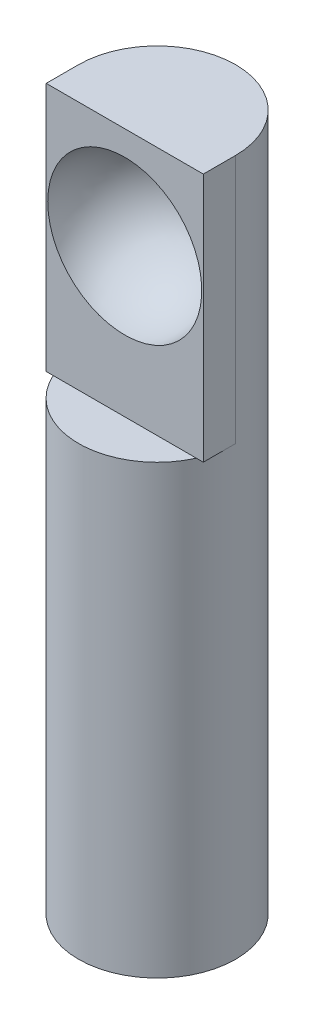
ISO-10303-21;
HEADER;
FILE_DESCRIPTION(('STEP AP214'),'2;1');
FILE_NAME('part.step','',(''),(''),'','','');
FILE_SCHEMA(('AUTOMOTIVE_DESIGN { 1 0 10303 214 1 1 1 1 }'));
ENDSEC;
DATA;
#1=APPLICATION_CONTEXT('core data for automotive mechanical design processes');
#2=APPLICATION_PROTOCOL_DEFINITION('international standard','automotive_design',2000,#1);
#3=PRODUCT_CONTEXT('',#1,'mechanical');
#4=PRODUCT('Part','Part','',(#3));
#5=PRODUCT_RELATED_PRODUCT_CATEGORY('part','',(#4));
#6=PRODUCT_DEFINITION_FORMATION('','',#4);
#7=PRODUCT_DEFINITION_CONTEXT('part definition',#1,'design');
#8=PRODUCT_DEFINITION('design','',#6,#7);
#9=PRODUCT_DEFINITION_SHAPE('','',#8);
#10=(LENGTH_UNIT() NAMED_UNIT(*) SI_UNIT(.MILLI.,.METRE.));
#11=(NAMED_UNIT(*) PLANE_ANGLE_UNIT() SI_UNIT($,.RADIAN.));
#12=(NAMED_UNIT(*) SI_UNIT($,.STERADIAN.) SOLID_ANGLE_UNIT());
#13=UNCERTAINTY_MEASURE_WITH_UNIT(LENGTH_MEASURE(1.E-05),#10,'distance_accuracy_value','');
#14=(GEOMETRIC_REPRESENTATION_CONTEXT(3) GLOBAL_UNCERTAINTY_ASSIGNED_CONTEXT((#13)) GLOBAL_UNIT_ASSIGNED_CONTEXT((#10,
#11,#12)) REPRESENTATION_CONTEXT('',''));
#15=CARTESIAN_POINT('',(0.,0.,0.));
#16=DIRECTION('',(0.,0.,1.));
#17=DIRECTION('',(1.,0.,0.));
#18=AXIS2_PLACEMENT_3D('',#15,#16,#17);
#19=CARTESIAN_POINT('',(-2.55,11.3,2.55));
#20=DIRECTION('',(0.,-1.,0.));
#21=DIRECTION('',(0.,0.,-1.));
#22=AXIS2_PLACEMENT_3D('',#19,#20,#21);
#23=PLANE('',#22);
#24=DIRECTION('',(0.,0.,-1.));
#25=VECTOR('',#24,1.);
#26=CARTESIAN_POINT('',(2.55,11.3,2.55));
#27=LINE('',#26,#25);
#28=CARTESIAN_POINT('',(2.55,11.3,1.05));
#29=VERTEX_POINT('',#28);
#30=CARTESIAN_POINT('',(2.55,11.3,0.));
#31=VERTEX_POINT('',#30);
#32=EDGE_CURVE('E77',#29,#31,#27,.T.);
#33=ORIENTED_EDGE('',*,*,#32,.T.);
#34=CARTESIAN_POINT('',(0.,11.3,0.));
#35=DIRECTION('',(0.,-1.,0.));
#36=DIRECTION('',(0.,0.,-1.));
#37=AXIS2_PLACEMENT_3D('',#34,#35,#36);
#38=CIRCLE('',#37,2.55);
#39=CARTESIAN_POINT('',(-2.55,11.3,0.));
#40=VERTEX_POINT('',#39);
#41=EDGE_CURVE('E115',#31,#40,#38,.F.);
#42=ORIENTED_EDGE('',*,*,#41,.T.);
#43=DIRECTION('',(0.,0.,-1.));
#44=VECTOR('',#43,1.);
#45=CARTESIAN_POINT('',(-2.55,11.3,2.55));
#46=LINE('',#45,#44);
#47=CARTESIAN_POINT('',(-2.55,11.3,1.05));
#48=VERTEX_POINT('',#47);
#49=EDGE_CURVE('E133',#48,#40,#46,.T.);
#50=ORIENTED_EDGE('',*,*,#49,.F.);
#51=DIRECTION('',(-1.,0.,0.));
#52=VECTOR('',#51,1.);
#53=CARTESIAN_POINT('',(2.55,11.3,1.05));
#54=LINE('',#53,#52);
#55=EDGE_CURVE('E132',#29,#48,#54,.T.);
#56=ORIENTED_EDGE('',*,*,#55,.F.);
#57=EDGE_LOOP('',(#33,#42,#50,#56));
#58=FACE_BOUND('',#57,.T.);
#59=ADVANCED_FACE('F68',(#58),#23,.F.);
#60=CARTESIAN_POINT('',(-2.55,-11.3,2.55));
#61=DIRECTION('',(1.,0.,0.));
#62=DIRECTION('',(0.,0.,-1.));
#63=AXIS2_PLACEMENT_3D('',#60,#61,#62);
#64=PLANE('',#63);
#65=DIRECTION('',(0.,-1.,0.));
#66=VECTOR('',#65,1.);
#67=CARTESIAN_POINT('',(-2.55,11.3,0.));
#68=LINE('',#67,#66);
#69=CARTESIAN_POINT('',(-2.55,3.2,0.));
#70=VERTEX_POINT('',#69);
#71=EDGE_CURVE('E118',#40,#70,#68,.T.);
#72=ORIENTED_EDGE('',*,*,#71,.T.);
#73=DIRECTION('',(0.,0.,-1.));
#74=VECTOR('',#73,1.);
#75=CARTESIAN_POINT('',(-2.55,3.2,0.));
#76=LINE('',#75,#74);
#77=CARTESIAN_POINT('',(-2.55,3.2,1.05));
#78=VERTEX_POINT('',#77);
#79=EDGE_CURVE('E138',#78,#70,#76,.T.);
#80=ORIENTED_EDGE('',*,*,#79,.F.);
#81=DIRECTION('',(0.,1.,0.));
#82=VECTOR('',#81,1.);
#83=CARTESIAN_POINT('',(-2.55,-2.1160135440008,1.05));
#84=LINE('',#83,#82);
#85=EDGE_CURVE('E154',#78,#48,#84,.T.);
#86=ORIENTED_EDGE('',*,*,#85,.T.);
#87=ORIENTED_EDGE('',*,*,#49,.T.);
#88=EDGE_LOOP('',(#72,#80,#86,#87));
#89=FACE_BOUND('',#88,.T.);
#90=ADVANCED_FACE('F175',(#89),#64,.F.);
#91=CARTESIAN_POINT('',(-2.55,-11.3,2.55));
#92=DIRECTION('',(0.,1.,0.));
#93=DIRECTION('',(0.,0.,1.));
#94=AXIS2_PLACEMENT_3D('',#91,#92,#93);
#95=PLANE('',#94);
#96=CARTESIAN_POINT('',(0.,-11.3,0.));
#97=DIRECTION('',(0.,-1.,0.));
#98=DIRECTION('',(0.,0.,-1.));
#99=AXIS2_PLACEMENT_3D('',#96,#97,#98);
#100=CIRCLE('',#99,2.55);
#101=CARTESIAN_POINT('',(0.,-11.3,-2.55));
#102=VERTEX_POINT('',#101);
#103=EDGE_CURVE('E135',#102,#102,#100,.T.);
#104=ORIENTED_EDGE('',*,*,#103,.T.);
#105=EDGE_LOOP('',(#104));
#106=FACE_BOUND('',#105,.T.);
#107=ADVANCED_FACE('F179',(#106),#95,.F.);
#108=CARTESIAN_POINT('',(2.55,-11.3,2.55));
#109=DIRECTION('',(-1.,0.,0.));
#110=DIRECTION('',(0.,0.,1.));
#111=AXIS2_PLACEMENT_3D('',#108,#109,#110);
#112=PLANE('',#111);
#113=DIRECTION('',(0.,0.,1.));
#114=VECTOR('',#113,1.);
#115=CARTESIAN_POINT('',(2.55,3.2,0.));
#116=LINE('',#115,#114);
#117=CARTESIAN_POINT('',(2.55,3.2,0.));
#118=VERTEX_POINT('',#117);
#119=CARTESIAN_POINT('',(2.55,3.2,1.05));
#120=VERTEX_POINT('',#119);
#121=EDGE_CURVE('E129',#118,#120,#116,.T.);
#122=ORIENTED_EDGE('',*,*,#121,.F.);
#123=DIRECTION('',(0.,-1.,0.));
#124=VECTOR('',#123,1.);
#125=CARTESIAN_POINT('',(2.55,11.3,0.));
#126=LINE('',#125,#124);
#127=EDGE_CURVE('E91',#31,#118,#126,.T.);
#128=ORIENTED_EDGE('',*,*,#127,.F.);
#129=ORIENTED_EDGE('',*,*,#32,.F.);
#130=DIRECTION('',(0.,1.,0.));
#131=VECTOR('',#130,1.);
#132=CARTESIAN_POINT('',(2.55,-2.1160135440008,1.05));
#133=LINE('',#132,#131);
#134=EDGE_CURVE('E152',#120,#29,#133,.T.);
#135=ORIENTED_EDGE('',*,*,#134,.F.);
#136=EDGE_LOOP('',(#122,#128,#129,#135));
#137=FACE_BOUND('',#136,.T.);
#138=ADVANCED_FACE('F70',(#137),#112,.F.);
#139=CARTESIAN_POINT('',(2.55,3.2,-3.55));
#140=DIRECTION('',(0.,1.,0.));
#141=DIRECTION('',(0.,0.,1.));
#142=AXIS2_PLACEMENT_3D('',#139,#140,#141);
#143=PLANE('',#142);
#144=CARTESIAN_POINT('',(0.,3.2,0.));
#145=DIRECTION('',(0.,1.,0.));
#146=DIRECTION('',(0.,0.,1.));
#147=AXIS2_PLACEMENT_3D('',#144,#145,#146);
#148=CIRCLE('',#147,2.55);
#149=CARTESIAN_POINT('',(-2.32379000772445,3.2,1.05));
#150=VERTEX_POINT('',#149);
#151=EDGE_CURVE('E142',#150,#70,#148,.F.);
#152=ORIENTED_EDGE('',*,*,#151,.F.);
#153=DIRECTION('',(1.,0.,0.));
#154=VECTOR('',#153,1.);
#155=CARTESIAN_POINT('',(2.55,3.2,1.05));
#156=LINE('',#155,#154);
#157=EDGE_CURVE('E148',#78,#150,#156,.T.);
#158=ORIENTED_EDGE('',*,*,#157,.F.);
#159=ORIENTED_EDGE('',*,*,#79,.T.);
#160=EDGE_LOOP('',(#152,#158,#159));
#161=FACE_BOUND('',#160,.T.);
#162=ADVANCED_FACE('F185',(#161),#143,.F.);
#163=CARTESIAN_POINT('',(0.,6.8062445840514,0.));
#164=DIRECTION('',(0.,-1.,0.));
#165=DIRECTION('',(0.,0.,-1.));
#166=AXIS2_PLACEMENT_3D('',#163,#164,#165);
#167=CYLINDRICAL_SURFACE('',#166,2.55);
#168=ORIENTED_EDGE('',*,*,#103,.F.);
#169=EDGE_LOOP('',(#168));
#170=FACE_BOUND('',#169,.T.);
#171=CARTESIAN_POINT('',(2.32379000772445,3.2,1.05));
#172=VERTEX_POINT('',#171);
#173=EDGE_CURVE('E83',#172,#150,#148,.F.);
#174=ORIENTED_EDGE('',*,*,#173,.T.);
#175=ORIENTED_EDGE('',*,*,#151,.T.);
#176=ORIENTED_EDGE('',*,*,#71,.F.);
#177=ORIENTED_EDGE('',*,*,#41,.F.);
#178=ORIENTED_EDGE('',*,*,#127,.T.);
#179=CARTESIAN_POINT('',(0.,3.2,0.));
#180=DIRECTION('',(0.,1.,0.));
#181=DIRECTION('',(0.,0.,1.));
#182=AXIS2_PLACEMENT_3D('',#179,#180,#181);
#183=CIRCLE('',#182,2.55);
#184=EDGE_CURVE('E146',#118,#172,#183,.F.);
#185=ORIENTED_EDGE('',*,*,#184,.T.);
#186=EDGE_LOOP('',(#174,#175,#176,#177,#178,#185));
#187=FACE_BOUND('',#186,.T.);
#188=ADVANCED_FACE('F116',(#170,#187),#167,.T.);
#189=CARTESIAN_POINT('',(2.55,3.2,-3.55));
#190=DIRECTION('',(0.,1.,0.));
#191=DIRECTION('',(0.,0.,1.));
#192=AXIS2_PLACEMENT_3D('',#189,#190,#191);
#193=PLANE('',#192);
#194=ORIENTED_EDGE('',*,*,#121,.T.);
#195=DIRECTION('',(-1.,0.,0.));
#196=VECTOR('',#195,1.);
#197=CARTESIAN_POINT('',(2.55,3.2,1.05));
#198=LINE('',#197,#196);
#199=EDGE_CURVE('E12',#120,#172,#198,.T.);
#200=ORIENTED_EDGE('',*,*,#199,.T.);
#201=ORIENTED_EDGE('',*,*,#184,.F.);
#202=EDGE_LOOP('',(#194,#200,#201));
#203=FACE_BOUND('',#202,.T.);
#204=ADVANCED_FACE('F191',(#203),#193,.F.);
#205=CARTESIAN_POINT('',(2.55,-2.1160135440008,1.05));
#206=DIRECTION('',(0.,0.,-1.));
#207=DIRECTION('',(-1.,0.,0.));
#208=AXIS2_PLACEMENT_3D('',#205,#206,#207);
#209=PLANE('',#208);
#210=CARTESIAN_POINT('',(0.,8.,1.05));
#211=DIRECTION('',(0.,0.,-1.));
#212=DIRECTION('',(-1.,0.,0.));
#213=AXIS2_PLACEMENT_3D('',#210,#211,#212);
#214=CIRCLE('',#213,2.5);
#215=CARTESIAN_POINT('',(-2.5,8.,1.05));
#216=VERTEX_POINT('',#215);
#217=EDGE_CURVE('E72',#216,#216,#214,.T.);
#218=ORIENTED_EDGE('',*,*,#217,.T.);
#219=EDGE_LOOP('',(#218));
#220=FACE_BOUND('',#219,.T.);
#221=ORIENTED_EDGE('',*,*,#157,.T.);
#222=EDGE_CURVE('E151',#150,#172,#156,.T.);
#223=ORIENTED_EDGE('',*,*,#222,.T.);
#224=ORIENTED_EDGE('',*,*,#199,.F.);
#225=ORIENTED_EDGE('',*,*,#134,.T.);
#226=ORIENTED_EDGE('',*,*,#55,.T.);
#227=ORIENTED_EDGE('',*,*,#85,.F.);
#228=EDGE_LOOP('',(#221,#223,#224,#225,#226,#227));
#229=FACE_BOUND('',#228,.T.);
#230=ADVANCED_FACE('F163',(#220,#229),#209,.F.);
#231=CARTESIAN_POINT('',(2.55,3.2,-3.55));
#232=DIRECTION('',(0.,1.,0.));
#233=DIRECTION('',(0.,0.,1.));
#234=AXIS2_PLACEMENT_3D('',#231,#232,#233);
#235=PLANE('',#234);
#236=ORIENTED_EDGE('',*,*,#173,.F.);
#237=ORIENTED_EDGE('',*,*,#222,.F.);
#238=EDGE_LOOP('',(#236,#237));
#239=FACE_BOUND('',#238,.T.);
#240=ADVANCED_FACE('F168',(#239),#235,.T.);
#241=CARTESIAN_POINT('',(0.,8.,1.05));
#242=DIRECTION('',(-1.,0.,0.));
#243=DIRECTION('',(0.,1.,0.));
#244=AXIS2_PLACEMENT_3D('',#241,#242,#243);
#245=SPHERICAL_SURFACE('',#244,2.5);
#246=CARTESIAN_POINT('',(0.,8.,1.05));
#247=DIRECTION('',(0.,0.,-1.));
#248=DIRECTION('',(-1.,0.,0.));
#249=AXIS2_PLACEMENT_3D('',#246,#247,#248);
#250=SPHERICAL_SURFACE('',#249,2.5);
#251=ORIENTED_EDGE('',*,*,#217,.F.);
#252=EDGE_LOOP('',(#251));
#253=FACE_BOUND('',#252,.T.);
#254=ADVANCED_FACE('F166',(#253),#250,.F.);
#255=CLOSED_SHELL('',(#59,#90,#107,#138,#162,#188,#204,#230,#240,#254));
#256=MANIFOLD_SOLID_BREP('B2',#255);
#257=ADVANCED_BREP_SHAPE_REPRESENTATION('',(#18,#256),#14);
#258=SHAPE_DEFINITION_REPRESENTATION(#9,#257);
ENDSEC;
END-ISO-10303-21;
